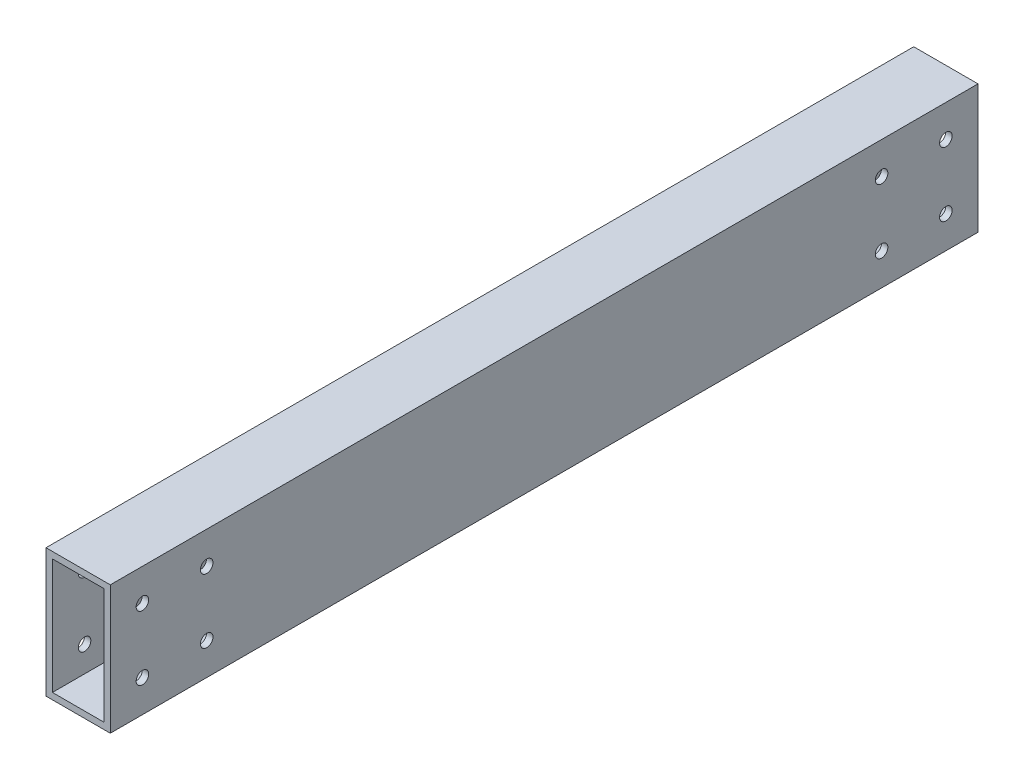
ISO-10303-21;
HEADER;
FILE_DESCRIPTION(('STEP AP214'),'2;1');
FILE_NAME('part.step','',(''),(''),'','','');
FILE_SCHEMA(('AUTOMOTIVE_DESIGN { 1 0 10303 214 1 1 1 1 }'));
ENDSEC;
DATA;
#1=APPLICATION_CONTEXT('core data for automotive mechanical design processes');
#2=APPLICATION_PROTOCOL_DEFINITION('international standard','automotive_design',2000,#1);
#3=PRODUCT_CONTEXT('',#1,'mechanical');
#4=PRODUCT('Part','Part','',(#3));
#5=PRODUCT_RELATED_PRODUCT_CATEGORY('part','',(#4));
#6=PRODUCT_DEFINITION_FORMATION('','',#4);
#7=PRODUCT_DEFINITION_CONTEXT('part definition',#1,'design');
#8=PRODUCT_DEFINITION('design','',#6,#7);
#9=PRODUCT_DEFINITION_SHAPE('','',#8);
#10=(LENGTH_UNIT() NAMED_UNIT(*) SI_UNIT(.MILLI.,.METRE.));
#11=(NAMED_UNIT(*) PLANE_ANGLE_UNIT() SI_UNIT($,.RADIAN.));
#12=(NAMED_UNIT(*) SI_UNIT($,.STERADIAN.) SOLID_ANGLE_UNIT());
#13=UNCERTAINTY_MEASURE_WITH_UNIT(LENGTH_MEASURE(1.E-05),#10,'distance_accuracy_value','');
#14=(GEOMETRIC_REPRESENTATION_CONTEXT(3) GLOBAL_UNCERTAINTY_ASSIGNED_CONTEXT((#13)) GLOBAL_UNIT_ASSIGNED_CONTEXT((#10,
#11,#12)) REPRESENTATION_CONTEXT('',''));
#15=CARTESIAN_POINT('',(0.,0.,0.));
#16=DIRECTION('',(0.,0.,1.));
#17=DIRECTION('',(1.,0.,0.));
#18=AXIS2_PLACEMENT_3D('',#15,#16,#17);
#19=CARTESIAN_POINT('',(12.7,-25.4,-171.45));
#20=DIRECTION('',(1.,0.,0.));
#21=DIRECTION('',(0.,0.,-1.));
#22=AXIS2_PLACEMENT_3D('',#19,#20,#21);
#23=PLANE('',#22);
#24=CARTESIAN_POINT('',(12.7,12.7,133.35));
#25=DIRECTION('',(1.,0.,0.));
#26=DIRECTION('',(0.,0.,-1.));
#27=AXIS2_PLACEMENT_3D('',#24,#25,#26);
#28=CIRCLE('',#27,2.4765);
#29=CARTESIAN_POINT('',(12.7,12.7,130.8735));
#30=VERTEX_POINT('',#29);
#31=EDGE_CURVE('E257',#30,#30,#28,.T.);
#32=ORIENTED_EDGE('',*,*,#31,.F.);
#33=EDGE_LOOP('',(#32));
#34=FACE_BOUND('',#33,.T.);
#35=CARTESIAN_POINT('',(12.7,12.7,-158.75));
#36=DIRECTION('',(1.,0.,0.));
#37=DIRECTION('',(0.,0.,-1.));
#38=AXIS2_PLACEMENT_3D('',#35,#36,#37);
#39=CIRCLE('',#38,2.4765);
#40=CARTESIAN_POINT('',(12.7,12.7,-161.2265));
#41=VERTEX_POINT('',#40);
#42=EDGE_CURVE('E256',#41,#41,#39,.T.);
#43=ORIENTED_EDGE('',*,*,#42,.F.);
#44=EDGE_LOOP('',(#43));
#45=FACE_BOUND('',#44,.T.);
#46=CARTESIAN_POINT('',(12.7,-12.7,-158.75));
#47=DIRECTION('',(1.,0.,0.));
#48=DIRECTION('',(0.,0.,-1.));
#49=AXIS2_PLACEMENT_3D('',#46,#47,#48);
#50=CIRCLE('',#49,2.4765);
#51=CARTESIAN_POINT('',(12.7,-12.7,-161.2265));
#52=VERTEX_POINT('',#51);
#53=EDGE_CURVE('E245',#52,#52,#50,.T.);
#54=ORIENTED_EDGE('',*,*,#53,.F.);
#55=EDGE_LOOP('',(#54));
#56=FACE_BOUND('',#55,.T.);
#57=CARTESIAN_POINT('',(12.7,12.7,-133.35));
#58=DIRECTION('',(1.,0.,0.));
#59=DIRECTION('',(0.,0.,-1.));
#60=AXIS2_PLACEMENT_3D('',#57,#58,#59);
#61=CIRCLE('',#60,2.4765);
#62=CARTESIAN_POINT('',(12.7,12.7,-135.8265));
#63=VERTEX_POINT('',#62);
#64=EDGE_CURVE('E244',#63,#63,#61,.T.);
#65=ORIENTED_EDGE('',*,*,#64,.F.);
#66=EDGE_LOOP('',(#65));
#67=FACE_BOUND('',#66,.T.);
#68=CARTESIAN_POINT('',(12.7,12.7,158.75));
#69=DIRECTION('',(1.,0.,0.));
#70=DIRECTION('',(0.,0.,-1.));
#71=AXIS2_PLACEMENT_3D('',#68,#69,#70);
#72=CIRCLE('',#71,2.4765);
#73=CARTESIAN_POINT('',(12.7,12.7,156.2735));
#74=VERTEX_POINT('',#73);
#75=EDGE_CURVE('E275',#74,#74,#72,.T.);
#76=ORIENTED_EDGE('',*,*,#75,.F.);
#77=EDGE_LOOP('',(#76));
#78=FACE_BOUND('',#77,.T.);
#79=CARTESIAN_POINT('',(12.7,-12.7,158.75));
#80=DIRECTION('',(1.,0.,0.));
#81=DIRECTION('',(0.,0.,-1.));
#82=AXIS2_PLACEMENT_3D('',#79,#80,#81);
#83=CIRCLE('',#82,2.4765);
#84=CARTESIAN_POINT('',(12.7,-12.7,156.2735));
#85=VERTEX_POINT('',#84);
#86=EDGE_CURVE('E268',#85,#85,#83,.T.);
#87=ORIENTED_EDGE('',*,*,#86,.F.);
#88=EDGE_LOOP('',(#87));
#89=FACE_BOUND('',#88,.T.);
#90=CARTESIAN_POINT('',(12.7,-12.7,133.35));
#91=DIRECTION('',(1.,0.,0.));
#92=DIRECTION('',(0.,0.,-1.));
#93=AXIS2_PLACEMENT_3D('',#90,#91,#92);
#94=CIRCLE('',#93,2.4765);
#95=CARTESIAN_POINT('',(12.7,-12.7,130.8735));
#96=VERTEX_POINT('',#95);
#97=EDGE_CURVE('E269',#96,#96,#94,.T.);
#98=ORIENTED_EDGE('',*,*,#97,.F.);
#99=EDGE_LOOP('',(#98));
#100=FACE_BOUND('',#99,.T.);
#101=CARTESIAN_POINT('',(12.7,-12.7,-133.35));
#102=DIRECTION('',(1.,0.,0.));
#103=DIRECTION('',(0.,0.,-1.));
#104=AXIS2_PLACEMENT_3D('',#101,#102,#103);
#105=CIRCLE('',#104,2.4765);
#106=CARTESIAN_POINT('',(12.7,-12.7,-135.8265));
#107=VERTEX_POINT('',#106);
#108=EDGE_CURVE('E237',#107,#107,#105,.T.);
#109=ORIENTED_EDGE('',*,*,#108,.F.);
#110=EDGE_LOOP('',(#109));
#111=FACE_BOUND('',#110,.T.);
#112=DIRECTION('',(0.,1.,0.));
#113=VECTOR('',#112,1.);
#114=CARTESIAN_POINT('',(12.7,-25.4,171.45));
#115=LINE('',#114,#113);
#116=CARTESIAN_POINT('',(12.7,-25.4,171.45));
#117=VERTEX_POINT('',#116);
#118=CARTESIAN_POINT('',(12.7,25.4,171.45));
#119=VERTEX_POINT('',#118);
#120=EDGE_CURVE('E158',#117,#119,#115,.T.);
#121=ORIENTED_EDGE('',*,*,#120,.F.);
#122=DIRECTION('',(0.,0.,1.));
#123=VECTOR('',#122,1.);
#124=CARTESIAN_POINT('',(12.7,-25.4,-171.45));
#125=LINE('',#124,#123);
#126=CARTESIAN_POINT('',(12.7,-25.4,-171.45));
#127=VERTEX_POINT('',#126);
#128=EDGE_CURVE('E12',#127,#117,#125,.T.);
#129=ORIENTED_EDGE('',*,*,#128,.F.);
#130=DIRECTION('',(0.,1.,0.));
#131=VECTOR('',#130,1.);
#132=CARTESIAN_POINT('',(12.7,-25.4,-171.45));
#133=LINE('',#132,#131);
#134=CARTESIAN_POINT('',(12.7,25.4,-171.45));
#135=VERTEX_POINT('',#134);
#136=EDGE_CURVE('E162',#127,#135,#133,.T.);
#137=ORIENTED_EDGE('',*,*,#136,.T.);
#138=DIRECTION('',(0.,0.,1.));
#139=VECTOR('',#138,1.);
#140=CARTESIAN_POINT('',(12.7,25.4,-171.45));
#141=LINE('',#140,#139);
#142=EDGE_CURVE('E175',#135,#119,#141,.T.);
#143=ORIENTED_EDGE('',*,*,#142,.T.);
#144=EDGE_LOOP('',(#121,#129,#137,#143));
#145=FACE_BOUND('',#144,.T.);
#146=ADVANCED_FACE('F57',(#34,#45,#56,#67,#78,#89,#100,#111,#145),#23,.T.);
#147=CARTESIAN_POINT('',(-12.7,-25.4,-171.45));
#148=DIRECTION('',(0.,-1.,0.));
#149=DIRECTION('',(0.,0.,-1.));
#150=AXIS2_PLACEMENT_3D('',#147,#148,#149);
#151=PLANE('',#150);
#152=DIRECTION('',(1.,0.,0.));
#153=VECTOR('',#152,1.);
#154=CARTESIAN_POINT('',(-12.7,-25.4,171.45));
#155=LINE('',#154,#153);
#156=CARTESIAN_POINT('',(-12.7,-25.4,171.45));
#157=VERTEX_POINT('',#156);
#158=EDGE_CURVE('E166',#157,#117,#155,.T.);
#159=ORIENTED_EDGE('',*,*,#158,.F.);
#160=DIRECTION('',(0.,0.,1.));
#161=VECTOR('',#160,1.);
#162=CARTESIAN_POINT('',(-12.7,-25.4,-171.45));
#163=LINE('',#162,#161);
#164=CARTESIAN_POINT('',(-12.7,-25.4,-171.45));
#165=VERTEX_POINT('',#164);
#166=EDGE_CURVE('E65',#165,#157,#163,.T.);
#167=ORIENTED_EDGE('',*,*,#166,.F.);
#168=DIRECTION('',(1.,0.,0.));
#169=VECTOR('',#168,1.);
#170=CARTESIAN_POINT('',(-12.7,-25.4,-171.45));
#171=LINE('',#170,#169);
#172=EDGE_CURVE('E172',#165,#127,#171,.T.);
#173=ORIENTED_EDGE('',*,*,#172,.T.);
#174=ORIENTED_EDGE('',*,*,#128,.T.);
#175=EDGE_LOOP('',(#159,#167,#173,#174));
#176=FACE_BOUND('',#175,.T.);
#177=ADVANCED_FACE('F288',(#176),#151,.T.);
#178=CARTESIAN_POINT('',(-12.7,-25.4,-171.45));
#179=DIRECTION('',(-1.,0.,0.));
#180=DIRECTION('',(0.,0.,1.));
#181=AXIS2_PLACEMENT_3D('',#178,#179,#180);
#182=PLANE('',#181);
#183=CARTESIAN_POINT('',(-12.7,12.7,133.35));
#184=DIRECTION('',(1.,0.,0.));
#185=DIRECTION('',(0.,0.,-1.));
#186=AXIS2_PLACEMENT_3D('',#183,#184,#185);
#187=CIRCLE('',#186,2.4765);
#188=CARTESIAN_POINT('',(-12.7,12.7,130.8735));
#189=VERTEX_POINT('',#188);
#190=EDGE_CURVE('E253',#189,#189,#187,.T.);
#191=ORIENTED_EDGE('',*,*,#190,.T.);
#192=EDGE_LOOP('',(#191));
#193=FACE_BOUND('',#192,.T.);
#194=CARTESIAN_POINT('',(-12.7,12.7,-158.75));
#195=DIRECTION('',(1.,0.,0.));
#196=DIRECTION('',(0.,0.,-1.));
#197=AXIS2_PLACEMENT_3D('',#194,#195,#196);
#198=CIRCLE('',#197,2.4765);
#199=CARTESIAN_POINT('',(-12.7,12.7,-161.2265));
#200=VERTEX_POINT('',#199);
#201=EDGE_CURVE('E248',#200,#200,#198,.T.);
#202=ORIENTED_EDGE('',*,*,#201,.T.);
#203=EDGE_LOOP('',(#202));
#204=FACE_BOUND('',#203,.T.);
#205=CARTESIAN_POINT('',(-12.7,-12.7,-158.75));
#206=DIRECTION('',(1.,0.,0.));
#207=DIRECTION('',(0.,0.,-1.));
#208=AXIS2_PLACEMENT_3D('',#205,#206,#207);
#209=CIRCLE('',#208,2.4765);
#210=CARTESIAN_POINT('',(-12.7,-12.7,-161.2265));
#211=VERTEX_POINT('',#210);
#212=EDGE_CURVE('E241',#211,#211,#209,.T.);
#213=ORIENTED_EDGE('',*,*,#212,.T.);
#214=EDGE_LOOP('',(#213));
#215=FACE_BOUND('',#214,.T.);
#216=CARTESIAN_POINT('',(-12.7,12.7,-133.35));
#217=DIRECTION('',(1.,0.,0.));
#218=DIRECTION('',(0.,0.,-1.));
#219=AXIS2_PLACEMENT_3D('',#216,#217,#218);
#220=CIRCLE('',#219,2.4765);
#221=CARTESIAN_POINT('',(-12.7,12.7,-135.8265));
#222=VERTEX_POINT('',#221);
#223=EDGE_CURVE('E240',#222,#222,#220,.T.);
#224=ORIENTED_EDGE('',*,*,#223,.T.);
#225=EDGE_LOOP('',(#224));
#226=FACE_BOUND('',#225,.T.);
#227=CARTESIAN_POINT('',(-12.7,12.7,158.75));
#228=DIRECTION('',(1.,0.,0.));
#229=DIRECTION('',(0.,0.,-1.));
#230=AXIS2_PLACEMENT_3D('',#227,#228,#229);
#231=CIRCLE('',#230,2.4765);
#232=CARTESIAN_POINT('',(-12.7,12.7,156.2735));
#233=VERTEX_POINT('',#232);
#234=EDGE_CURVE('E260',#233,#233,#231,.T.);
#235=ORIENTED_EDGE('',*,*,#234,.T.);
#236=EDGE_LOOP('',(#235));
#237=FACE_BOUND('',#236,.T.);
#238=CARTESIAN_POINT('',(-12.7,-12.7,158.75));
#239=DIRECTION('',(1.,0.,0.));
#240=DIRECTION('',(0.,0.,-1.));
#241=AXIS2_PLACEMENT_3D('',#238,#239,#240);
#242=CIRCLE('',#241,2.4765);
#243=CARTESIAN_POINT('',(-12.7,-12.7,156.2735));
#244=VERTEX_POINT('',#243);
#245=EDGE_CURVE('E272',#244,#244,#242,.T.);
#246=ORIENTED_EDGE('',*,*,#245,.T.);
#247=EDGE_LOOP('',(#246));
#248=FACE_BOUND('',#247,.T.);
#249=CARTESIAN_POINT('',(-12.7,-12.7,133.35));
#250=DIRECTION('',(1.,0.,0.));
#251=DIRECTION('',(0.,0.,-1.));
#252=AXIS2_PLACEMENT_3D('',#249,#250,#251);
#253=CIRCLE('',#252,2.4765);
#254=CARTESIAN_POINT('',(-12.7,-12.7,130.8735));
#255=VERTEX_POINT('',#254);
#256=EDGE_CURVE('E265',#255,#255,#253,.T.);
#257=ORIENTED_EDGE('',*,*,#256,.T.);
#258=EDGE_LOOP('',(#257));
#259=FACE_BOUND('',#258,.T.);
#260=CARTESIAN_POINT('',(-12.7,-12.7,-133.35));
#261=DIRECTION('',(1.,0.,0.));
#262=DIRECTION('',(0.,0.,-1.));
#263=AXIS2_PLACEMENT_3D('',#260,#261,#262);
#264=CIRCLE('',#263,2.4765);
#265=CARTESIAN_POINT('',(-12.7,-12.7,-135.8265));
#266=VERTEX_POINT('',#265);
#267=EDGE_CURVE('E194',#266,#266,#264,.T.);
#268=ORIENTED_EDGE('',*,*,#267,.T.);
#269=EDGE_LOOP('',(#268));
#270=FACE_BOUND('',#269,.T.);
#271=DIRECTION('',(0.,-1.,0.));
#272=VECTOR('',#271,1.);
#273=CARTESIAN_POINT('',(-12.7,-25.4,171.45));
#274=LINE('',#273,#272);
#275=CARTESIAN_POINT('',(-12.7,25.4,171.45));
#276=VERTEX_POINT('',#275);
#277=EDGE_CURVE('E181',#276,#157,#274,.T.);
#278=ORIENTED_EDGE('',*,*,#277,.F.);
#279=DIRECTION('',(0.,0.,1.));
#280=VECTOR('',#279,1.);
#281=CARTESIAN_POINT('',(-12.7,25.4,-171.45));
#282=LINE('',#281,#280);
#283=CARTESIAN_POINT('',(-12.7,25.4,-171.45));
#284=VERTEX_POINT('',#283);
#285=EDGE_CURVE('E187',#284,#276,#282,.T.);
#286=ORIENTED_EDGE('',*,*,#285,.F.);
#287=DIRECTION('',(0.,-1.,0.));
#288=VECTOR('',#287,1.);
#289=CARTESIAN_POINT('',(-12.7,-25.4,-171.45));
#290=LINE('',#289,#288);
#291=EDGE_CURVE('E169',#284,#165,#290,.T.);
#292=ORIENTED_EDGE('',*,*,#291,.T.);
#293=ORIENTED_EDGE('',*,*,#166,.T.);
#294=EDGE_LOOP('',(#278,#286,#292,#293));
#295=FACE_BOUND('',#294,.T.);
#296=ADVANCED_FACE('F310',(#193,#204,#215,#226,#237,#248,#259,#270,#295),#182,.T.);
#297=CARTESIAN_POINT('',(-12.7,25.4,-171.45));
#298=DIRECTION('',(0.,1.,0.));
#299=DIRECTION('',(0.,0.,1.));
#300=AXIS2_PLACEMENT_3D('',#297,#298,#299);
#301=PLANE('',#300);
#302=DIRECTION('',(-1.,0.,0.));
#303=VECTOR('',#302,1.);
#304=CARTESIAN_POINT('',(-12.7,25.4,171.45));
#305=LINE('',#304,#303);
#306=EDGE_CURVE('E178',#119,#276,#305,.T.);
#307=ORIENTED_EDGE('',*,*,#306,.F.);
#308=ORIENTED_EDGE('',*,*,#142,.F.);
#309=DIRECTION('',(-1.,0.,0.));
#310=VECTOR('',#309,1.);
#311=CARTESIAN_POINT('',(-12.7,25.4,-171.45));
#312=LINE('',#311,#310);
#313=EDGE_CURVE('E165',#135,#284,#312,.T.);
#314=ORIENTED_EDGE('',*,*,#313,.T.);
#315=ORIENTED_EDGE('',*,*,#285,.T.);
#316=EDGE_LOOP('',(#307,#308,#314,#315));
#317=FACE_BOUND('',#316,.T.);
#318=ADVANCED_FACE('F308',(#317),#301,.T.);
#319=CARTESIAN_POINT('',(0.,0.,-171.45));
#320=DIRECTION('',(0.,0.,1.));
#321=DIRECTION('',(1.,0.,0.));
#322=AXIS2_PLACEMENT_3D('',#319,#320,#321);
#323=PLANE('',#322);
#324=DIRECTION('',(1.,0.,0.));
#325=VECTOR('',#324,1.);
#326=CARTESIAN_POINT('',(0.,-22.86,-171.45));
#327=LINE('',#326,#325);
#328=CARTESIAN_POINT('',(-10.16,-22.86,-171.45));
#329=VERTEX_POINT('',#328);
#330=CARTESIAN_POINT('',(10.16,-22.86,-171.45));
#331=VERTEX_POINT('',#330);
#332=EDGE_CURVE('E130',#329,#331,#327,.T.);
#333=ORIENTED_EDGE('',*,*,#332,.T.);
#334=DIRECTION('',(0.,1.,0.));
#335=VECTOR('',#334,1.);
#336=CARTESIAN_POINT('',(10.16,0.,-171.45));
#337=LINE('',#336,#335);
#338=CARTESIAN_POINT('',(10.16,22.86,-171.45));
#339=VERTEX_POINT('',#338);
#340=EDGE_CURVE('E124',#331,#339,#337,.T.);
#341=ORIENTED_EDGE('',*,*,#340,.T.);
#342=DIRECTION('',(-1.,0.,0.));
#343=VECTOR('',#342,1.);
#344=CARTESIAN_POINT('',(0.,22.86,-171.45));
#345=LINE('',#344,#343);
#346=CARTESIAN_POINT('',(-10.16,22.86,-171.45));
#347=VERTEX_POINT('',#346);
#348=EDGE_CURVE('E133',#339,#347,#345,.T.);
#349=ORIENTED_EDGE('',*,*,#348,.T.);
#350=DIRECTION('',(0.,-1.,0.));
#351=VECTOR('',#350,1.);
#352=CARTESIAN_POINT('',(-10.16,0.,-171.45));
#353=LINE('',#352,#351);
#354=EDGE_CURVE('E73',#347,#329,#353,.T.);
#355=ORIENTED_EDGE('',*,*,#354,.T.);
#356=EDGE_LOOP('',(#333,#341,#349,#355));
#357=FACE_BOUND('',#356,.T.);
#358=ORIENTED_EDGE('',*,*,#136,.F.);
#359=ORIENTED_EDGE('',*,*,#172,.F.);
#360=ORIENTED_EDGE('',*,*,#291,.F.);
#361=ORIENTED_EDGE('',*,*,#313,.F.);
#362=EDGE_LOOP('',(#358,#359,#360,#361));
#363=FACE_BOUND('',#362,.T.);
#364=ADVANCED_FACE('F137',(#357,#363),#323,.F.);
#365=CARTESIAN_POINT('',(0.,0.,171.45));
#366=DIRECTION('',(0.,0.,1.));
#367=DIRECTION('',(1.,0.,0.));
#368=AXIS2_PLACEMENT_3D('',#365,#366,#367);
#369=PLANE('',#368);
#370=DIRECTION('',(0.,1.,0.));
#371=VECTOR('',#370,1.);
#372=CARTESIAN_POINT('',(10.16,0.,171.45));
#373=LINE('',#372,#371);
#374=CARTESIAN_POINT('',(10.16,-22.86,171.45));
#375=VERTEX_POINT('',#374);
#376=CARTESIAN_POINT('',(10.16,22.86,171.45));
#377=VERTEX_POINT('',#376);
#378=EDGE_CURVE('E81',#375,#377,#373,.T.);
#379=ORIENTED_EDGE('',*,*,#378,.F.);
#380=DIRECTION('',(1.,0.,0.));
#381=VECTOR('',#380,1.);
#382=CARTESIAN_POINT('',(0.,-22.86,171.45));
#383=LINE('',#382,#381);
#384=CARTESIAN_POINT('',(-10.16,-22.86,171.45));
#385=VERTEX_POINT('',#384);
#386=EDGE_CURVE('E140',#385,#375,#383,.T.);
#387=ORIENTED_EDGE('',*,*,#386,.F.);
#388=DIRECTION('',(0.,-1.,0.));
#389=VECTOR('',#388,1.);
#390=CARTESIAN_POINT('',(-10.16,0.,171.45));
#391=LINE('',#390,#389);
#392=CARTESIAN_POINT('',(-10.16,22.86,171.45));
#393=VERTEX_POINT('',#392);
#394=EDGE_CURVE('E143',#393,#385,#391,.T.);
#395=ORIENTED_EDGE('',*,*,#394,.F.);
#396=DIRECTION('',(-1.,0.,0.));
#397=VECTOR('',#396,1.);
#398=CARTESIAN_POINT('',(0.,22.86,171.45));
#399=LINE('',#398,#397);
#400=EDGE_CURVE('E152',#377,#393,#399,.T.);
#401=ORIENTED_EDGE('',*,*,#400,.F.);
#402=EDGE_LOOP('',(#379,#387,#395,#401));
#403=FACE_BOUND('',#402,.T.);
#404=ORIENTED_EDGE('',*,*,#120,.T.);
#405=ORIENTED_EDGE('',*,*,#306,.T.);
#406=ORIENTED_EDGE('',*,*,#277,.T.);
#407=ORIENTED_EDGE('',*,*,#158,.T.);
#408=EDGE_LOOP('',(#404,#405,#406,#407));
#409=FACE_BOUND('',#408,.T.);
#410=ADVANCED_FACE('F301',(#403,#409),#369,.T.);
#411=CARTESIAN_POINT('',(10.16,0.,-171.45));
#412=DIRECTION('',(1.,0.,0.));
#413=DIRECTION('',(0.,0.,-1.));
#414=AXIS2_PLACEMENT_3D('',#411,#412,#413);
#415=PLANE('',#414);
#416=CARTESIAN_POINT('',(10.16,12.7,133.35));
#417=DIRECTION('',(1.,0.,0.));
#418=DIRECTION('',(0.,0.,-1.));
#419=AXIS2_PLACEMENT_3D('',#416,#417,#418);
#420=CIRCLE('',#419,2.4765);
#421=CARTESIAN_POINT('',(10.16,12.7,130.8735));
#422=VERTEX_POINT('',#421);
#423=EDGE_CURVE('E146',#422,#422,#420,.T.);
#424=ORIENTED_EDGE('',*,*,#423,.T.);
#425=EDGE_LOOP('',(#424));
#426=FACE_BOUND('',#425,.T.);
#427=CARTESIAN_POINT('',(10.16,12.7,-158.75));
#428=DIRECTION('',(1.,0.,0.));
#429=DIRECTION('',(0.,0.,-1.));
#430=AXIS2_PLACEMENT_3D('',#427,#428,#429);
#431=CIRCLE('',#430,2.4765);
#432=CARTESIAN_POINT('',(10.16,12.7,-161.2265));
#433=VERTEX_POINT('',#432);
#434=EDGE_CURVE('E216',#433,#433,#431,.T.);
#435=ORIENTED_EDGE('',*,*,#434,.T.);
#436=EDGE_LOOP('',(#435));
#437=FACE_BOUND('',#436,.T.);
#438=CARTESIAN_POINT('',(10.16,-12.7,-158.75));
#439=DIRECTION('',(1.,0.,0.));
#440=DIRECTION('',(0.,0.,-1.));
#441=AXIS2_PLACEMENT_3D('',#438,#439,#440);
#442=CIRCLE('',#441,2.4765);
#443=CARTESIAN_POINT('',(10.16,-12.7,-161.2265));
#444=VERTEX_POINT('',#443);
#445=EDGE_CURVE('E213',#444,#444,#442,.T.);
#446=ORIENTED_EDGE('',*,*,#445,.T.);
#447=EDGE_LOOP('',(#446));
#448=FACE_BOUND('',#447,.T.);
#449=CARTESIAN_POINT('',(10.16,12.7,-133.35));
#450=DIRECTION('',(1.,0.,0.));
#451=DIRECTION('',(0.,0.,-1.));
#452=AXIS2_PLACEMENT_3D('',#449,#450,#451);
#453=CIRCLE('',#452,2.4765);
#454=CARTESIAN_POINT('',(10.16,12.7,-135.8265));
#455=VERTEX_POINT('',#454);
#456=EDGE_CURVE('E210',#455,#455,#453,.T.);
#457=ORIENTED_EDGE('',*,*,#456,.T.);
#458=EDGE_LOOP('',(#457));
#459=FACE_BOUND('',#458,.T.);
#460=CARTESIAN_POINT('',(10.16,12.7,158.75));
#461=DIRECTION('',(1.,0.,0.));
#462=DIRECTION('',(0.,0.,-1.));
#463=AXIS2_PLACEMENT_3D('',#460,#461,#462);
#464=CIRCLE('',#463,2.4765);
#465=CARTESIAN_POINT('',(10.16,12.7,156.2735));
#466=VERTEX_POINT('',#465);
#467=EDGE_CURVE('E206',#466,#466,#464,.T.);
#468=ORIENTED_EDGE('',*,*,#467,.T.);
#469=EDGE_LOOP('',(#468));
#470=FACE_BOUND('',#469,.T.);
#471=CARTESIAN_POINT('',(10.16,-12.7,158.75));
#472=DIRECTION('',(1.,0.,0.));
#473=DIRECTION('',(0.,0.,-1.));
#474=AXIS2_PLACEMENT_3D('',#471,#472,#473);
#475=CIRCLE('',#474,2.4765);
#476=CARTESIAN_POINT('',(10.16,-12.7,156.2735));
#477=VERTEX_POINT('',#476);
#478=EDGE_CURVE('E202',#477,#477,#475,.T.);
#479=ORIENTED_EDGE('',*,*,#478,.T.);
#480=EDGE_LOOP('',(#479));
#481=FACE_BOUND('',#480,.T.);
#482=CARTESIAN_POINT('',(10.16,-12.7,133.35));
#483=DIRECTION('',(1.,0.,0.));
#484=DIRECTION('',(0.,0.,-1.));
#485=AXIS2_PLACEMENT_3D('',#482,#483,#484);
#486=CIRCLE('',#485,2.4765);
#487=CARTESIAN_POINT('',(10.16,-12.7,130.8735));
#488=VERTEX_POINT('',#487);
#489=EDGE_CURVE('E198',#488,#488,#486,.T.);
#490=ORIENTED_EDGE('',*,*,#489,.T.);
#491=EDGE_LOOP('',(#490));
#492=FACE_BOUND('',#491,.T.);
#493=CARTESIAN_POINT('',(10.16,-12.7,-133.35));
#494=DIRECTION('',(1.,0.,0.));
#495=DIRECTION('',(0.,0.,-1.));
#496=AXIS2_PLACEMENT_3D('',#493,#494,#495);
#497=CIRCLE('',#496,2.4765);
#498=CARTESIAN_POINT('',(10.16,-12.7,-135.8265));
#499=VERTEX_POINT('',#498);
#500=EDGE_CURVE('E193',#499,#499,#497,.T.);
#501=ORIENTED_EDGE('',*,*,#500,.T.);
#502=EDGE_LOOP('',(#501));
#503=FACE_BOUND('',#502,.T.);
#504=ORIENTED_EDGE('',*,*,#378,.T.);
#505=DIRECTION('',(0.,0.,1.));
#506=VECTOR('',#505,1.);
#507=CARTESIAN_POINT('',(10.16,22.86,-171.45));
#508=LINE('',#507,#506);
#509=EDGE_CURVE('E120',#339,#377,#508,.T.);
#510=ORIENTED_EDGE('',*,*,#509,.F.);
#511=ORIENTED_EDGE('',*,*,#340,.F.);
#512=DIRECTION('',(0.,0.,1.));
#513=VECTOR('',#512,1.);
#514=CARTESIAN_POINT('',(10.16,-22.86,-171.45));
#515=LINE('',#514,#513);
#516=EDGE_CURVE('E156',#331,#375,#515,.T.);
#517=ORIENTED_EDGE('',*,*,#516,.T.);
#518=EDGE_LOOP('',(#504,#510,#511,#517));
#519=FACE_BOUND('',#518,.T.);
#520=ADVANCED_FACE('F122',(#426,#437,#448,#459,#470,#481,#492,#503,#519),#415,.F.);
#521=CARTESIAN_POINT('',(0.,-22.86,-171.45));
#522=DIRECTION('',(0.,-1.,0.));
#523=DIRECTION('',(0.,0.,-1.));
#524=AXIS2_PLACEMENT_3D('',#521,#522,#523);
#525=PLANE('',#524);
#526=ORIENTED_EDGE('',*,*,#386,.T.);
#527=ORIENTED_EDGE('',*,*,#516,.F.);
#528=ORIENTED_EDGE('',*,*,#332,.F.);
#529=DIRECTION('',(0.,0.,1.));
#530=VECTOR('',#529,1.);
#531=CARTESIAN_POINT('',(-10.16,-22.86,-171.45));
#532=LINE('',#531,#530);
#533=EDGE_CURVE('E159',#329,#385,#532,.T.);
#534=ORIENTED_EDGE('',*,*,#533,.T.);
#535=EDGE_LOOP('',(#526,#527,#528,#534));
#536=FACE_BOUND('',#535,.T.);
#537=ADVANCED_FACE('F328',(#536),#525,.F.);
#538=CARTESIAN_POINT('',(-10.16,0.,-171.45));
#539=DIRECTION('',(-1.,0.,0.));
#540=DIRECTION('',(0.,0.,1.));
#541=AXIS2_PLACEMENT_3D('',#538,#539,#540);
#542=PLANE('',#541);
#543=CARTESIAN_POINT('',(-10.16,12.7,133.35));
#544=DIRECTION('',(-1.,0.,0.));
#545=DIRECTION('',(0.,0.,1.));
#546=AXIS2_PLACEMENT_3D('',#543,#544,#545);
#547=CIRCLE('',#546,2.4765);
#548=CARTESIAN_POINT('',(-10.16,12.7,135.8265));
#549=VERTEX_POINT('',#548);
#550=EDGE_CURVE('E60',#549,#549,#547,.T.);
#551=ORIENTED_EDGE('',*,*,#550,.T.);
#552=EDGE_LOOP('',(#551));
#553=FACE_BOUND('',#552,.T.);
#554=CARTESIAN_POINT('',(-10.16,12.7,-158.75));
#555=DIRECTION('',(-1.,0.,0.));
#556=DIRECTION('',(0.,0.,1.));
#557=AXIS2_PLACEMENT_3D('',#554,#555,#556);
#558=CIRCLE('',#557,2.4765);
#559=CARTESIAN_POINT('',(-10.16,12.7,-156.2735));
#560=VERTEX_POINT('',#559);
#561=EDGE_CURVE('E214',#560,#560,#558,.T.);
#562=ORIENTED_EDGE('',*,*,#561,.T.);
#563=EDGE_LOOP('',(#562));
#564=FACE_BOUND('',#563,.T.);
#565=CARTESIAN_POINT('',(-10.16,-12.7,-158.75));
#566=DIRECTION('',(-1.,0.,0.));
#567=DIRECTION('',(0.,0.,1.));
#568=AXIS2_PLACEMENT_3D('',#565,#566,#567);
#569=CIRCLE('',#568,2.4765);
#570=CARTESIAN_POINT('',(-10.16,-12.7,-156.2735));
#571=VERTEX_POINT('',#570);
#572=EDGE_CURVE('E211',#571,#571,#569,.T.);
#573=ORIENTED_EDGE('',*,*,#572,.T.);
#574=EDGE_LOOP('',(#573));
#575=FACE_BOUND('',#574,.T.);
#576=CARTESIAN_POINT('',(-10.16,12.7,-133.35));
#577=DIRECTION('',(-1.,0.,0.));
#578=DIRECTION('',(0.,0.,1.));
#579=AXIS2_PLACEMENT_3D('',#576,#577,#578);
#580=CIRCLE('',#579,2.4765);
#581=CARTESIAN_POINT('',(-10.16,12.7,-130.8735));
#582=VERTEX_POINT('',#581);
#583=EDGE_CURVE('E207',#582,#582,#580,.T.);
#584=ORIENTED_EDGE('',*,*,#583,.T.);
#585=EDGE_LOOP('',(#584));
#586=FACE_BOUND('',#585,.T.);
#587=CARTESIAN_POINT('',(-10.16,12.7,158.75));
#588=DIRECTION('',(-1.,0.,0.));
#589=DIRECTION('',(0.,0.,1.));
#590=AXIS2_PLACEMENT_3D('',#587,#588,#589);
#591=CIRCLE('',#590,2.4765);
#592=CARTESIAN_POINT('',(-10.16,12.7,161.2265));
#593=VERTEX_POINT('',#592);
#594=EDGE_CURVE('E203',#593,#593,#591,.T.);
#595=ORIENTED_EDGE('',*,*,#594,.T.);
#596=EDGE_LOOP('',(#595));
#597=FACE_BOUND('',#596,.T.);
#598=CARTESIAN_POINT('',(-10.16,-12.7,158.75));
#599=DIRECTION('',(-1.,0.,0.));
#600=DIRECTION('',(0.,0.,1.));
#601=AXIS2_PLACEMENT_3D('',#598,#599,#600);
#602=CIRCLE('',#601,2.4765);
#603=CARTESIAN_POINT('',(-10.16,-12.7,161.2265));
#604=VERTEX_POINT('',#603);
#605=EDGE_CURVE('E199',#604,#604,#602,.T.);
#606=ORIENTED_EDGE('',*,*,#605,.T.);
#607=EDGE_LOOP('',(#606));
#608=FACE_BOUND('',#607,.T.);
#609=CARTESIAN_POINT('',(-10.16,-12.7,133.35));
#610=DIRECTION('',(-1.,0.,0.));
#611=DIRECTION('',(0.,0.,1.));
#612=AXIS2_PLACEMENT_3D('',#609,#610,#611);
#613=CIRCLE('',#612,2.4765);
#614=CARTESIAN_POINT('',(-10.16,-12.7,135.8265));
#615=VERTEX_POINT('',#614);
#616=EDGE_CURVE('E195',#615,#615,#613,.T.);
#617=ORIENTED_EDGE('',*,*,#616,.T.);
#618=EDGE_LOOP('',(#617));
#619=FACE_BOUND('',#618,.T.);
#620=CARTESIAN_POINT('',(-10.16,-12.7,-133.35));
#621=DIRECTION('',(-1.,0.,0.));
#622=DIRECTION('',(0.,0.,1.));
#623=AXIS2_PLACEMENT_3D('',#620,#621,#622);
#624=CIRCLE('',#623,2.4765);
#625=CARTESIAN_POINT('',(-10.16,-12.7,-130.8735));
#626=VERTEX_POINT('',#625);
#627=EDGE_CURVE('E190',#626,#626,#624,.T.);
#628=ORIENTED_EDGE('',*,*,#627,.T.);
#629=EDGE_LOOP('',(#628));
#630=FACE_BOUND('',#629,.T.);
#631=ORIENTED_EDGE('',*,*,#394,.T.);
#632=ORIENTED_EDGE('',*,*,#533,.F.);
#633=ORIENTED_EDGE('',*,*,#354,.F.);
#634=DIRECTION('',(0.,0.,1.));
#635=VECTOR('',#634,1.);
#636=CARTESIAN_POINT('',(-10.16,22.86,-171.45));
#637=LINE('',#636,#635);
#638=EDGE_CURVE('E129',#347,#393,#637,.T.);
#639=ORIENTED_EDGE('',*,*,#638,.T.);
#640=EDGE_LOOP('',(#631,#632,#633,#639));
#641=FACE_BOUND('',#640,.T.);
#642=ADVANCED_FACE('F333',(#553,#564,#575,#586,#597,#608,#619,#630,#641),#542,.F.);
#643=CARTESIAN_POINT('',(0.,22.86,-171.45));
#644=DIRECTION('',(0.,1.,0.));
#645=DIRECTION('',(0.,0.,1.));
#646=AXIS2_PLACEMENT_3D('',#643,#644,#645);
#647=PLANE('',#646);
#648=ORIENTED_EDGE('',*,*,#400,.T.);
#649=ORIENTED_EDGE('',*,*,#638,.F.);
#650=ORIENTED_EDGE('',*,*,#348,.F.);
#651=ORIENTED_EDGE('',*,*,#509,.T.);
#652=EDGE_LOOP('',(#648,#649,#650,#651));
#653=FACE_BOUND('',#652,.T.);
#654=ADVANCED_FACE('F134',(#653),#647,.F.);
#655=CARTESIAN_POINT('',(-12.7,-12.7,-133.35));
#656=DIRECTION('',(1.,0.,0.));
#657=DIRECTION('',(0.,0.,-1.));
#658=AXIS2_PLACEMENT_3D('',#655,#656,#657);
#659=CYLINDRICAL_SURFACE('',#658,2.4765);
#660=ORIENTED_EDGE('',*,*,#267,.F.);
#661=EDGE_LOOP('',(#660));
#662=FACE_BOUND('',#661,.T.);
#663=ORIENTED_EDGE('',*,*,#627,.F.);
#664=EDGE_LOOP('',(#663));
#665=FACE_BOUND('',#664,.T.);
#666=ADVANCED_FACE('F332',(#662,#665),#659,.F.);
#667=CARTESIAN_POINT('',(-12.7,-12.7,133.35));
#668=DIRECTION('',(1.,0.,0.));
#669=DIRECTION('',(0.,0.,-1.));
#670=AXIS2_PLACEMENT_3D('',#667,#668,#669);
#671=CYLINDRICAL_SURFACE('',#670,2.4765);
#672=ORIENTED_EDGE('',*,*,#256,.F.);
#673=EDGE_LOOP('',(#672));
#674=FACE_BOUND('',#673,.T.);
#675=ORIENTED_EDGE('',*,*,#616,.F.);
#676=EDGE_LOOP('',(#675));
#677=FACE_BOUND('',#676,.T.);
#678=ADVANCED_FACE('F369',(#674,#677),#671,.F.);
#679=CARTESIAN_POINT('',(-12.7,-12.7,158.75));
#680=DIRECTION('',(1.,0.,0.));
#681=DIRECTION('',(0.,0.,-1.));
#682=AXIS2_PLACEMENT_3D('',#679,#680,#681);
#683=CYLINDRICAL_SURFACE('',#682,2.4765);
#684=ORIENTED_EDGE('',*,*,#245,.F.);
#685=EDGE_LOOP('',(#684));
#686=FACE_BOUND('',#685,.T.);
#687=ORIENTED_EDGE('',*,*,#605,.F.);
#688=EDGE_LOOP('',(#687));
#689=FACE_BOUND('',#688,.T.);
#690=ADVANCED_FACE('F373',(#686,#689),#683,.F.);
#691=CARTESIAN_POINT('',(-12.7,12.7,158.75));
#692=DIRECTION('',(1.,0.,0.));
#693=DIRECTION('',(0.,0.,-1.));
#694=AXIS2_PLACEMENT_3D('',#691,#692,#693);
#695=CYLINDRICAL_SURFACE('',#694,2.4765);
#696=ORIENTED_EDGE('',*,*,#234,.F.);
#697=EDGE_LOOP('',(#696));
#698=FACE_BOUND('',#697,.T.);
#699=ORIENTED_EDGE('',*,*,#594,.F.);
#700=EDGE_LOOP('',(#699));
#701=FACE_BOUND('',#700,.T.);
#702=ADVANCED_FACE('F375',(#698,#701),#695,.F.);
#703=CARTESIAN_POINT('',(-12.7,12.7,-133.35));
#704=DIRECTION('',(1.,0.,0.));
#705=DIRECTION('',(0.,0.,-1.));
#706=AXIS2_PLACEMENT_3D('',#703,#704,#705);
#707=CYLINDRICAL_SURFACE('',#706,2.4765);
#708=ORIENTED_EDGE('',*,*,#223,.F.);
#709=EDGE_LOOP('',(#708));
#710=FACE_BOUND('',#709,.T.);
#711=ORIENTED_EDGE('',*,*,#583,.F.);
#712=EDGE_LOOP('',(#711));
#713=FACE_BOUND('',#712,.T.);
#714=ADVANCED_FACE('F356',(#710,#713),#707,.F.);
#715=CARTESIAN_POINT('',(-12.7,-12.7,-158.75));
#716=DIRECTION('',(1.,0.,0.));
#717=DIRECTION('',(0.,0.,-1.));
#718=AXIS2_PLACEMENT_3D('',#715,#716,#717);
#719=CYLINDRICAL_SURFACE('',#718,2.4765);
#720=ORIENTED_EDGE('',*,*,#212,.F.);
#721=EDGE_LOOP('',(#720));
#722=FACE_BOUND('',#721,.T.);
#723=ORIENTED_EDGE('',*,*,#572,.F.);
#724=EDGE_LOOP('',(#723));
#725=FACE_BOUND('',#724,.T.);
#726=ADVANCED_FACE('F352',(#722,#725),#719,.F.);
#727=CARTESIAN_POINT('',(-12.7,12.7,-158.75));
#728=DIRECTION('',(1.,0.,0.));
#729=DIRECTION('',(0.,0.,-1.));
#730=AXIS2_PLACEMENT_3D('',#727,#728,#729);
#731=CYLINDRICAL_SURFACE('',#730,2.4765);
#732=ORIENTED_EDGE('',*,*,#201,.F.);
#733=EDGE_LOOP('',(#732));
#734=FACE_BOUND('',#733,.T.);
#735=ORIENTED_EDGE('',*,*,#561,.F.);
#736=EDGE_LOOP('',(#735));
#737=FACE_BOUND('',#736,.T.);
#738=ADVANCED_FACE('F364',(#734,#737),#731,.F.);
#739=CARTESIAN_POINT('',(-12.7,12.7,133.35));
#740=DIRECTION('',(1.,0.,0.));
#741=DIRECTION('',(0.,0.,-1.));
#742=AXIS2_PLACEMENT_3D('',#739,#740,#741);
#743=CYLINDRICAL_SURFACE('',#742,2.4765);
#744=ORIENTED_EDGE('',*,*,#190,.F.);
#745=EDGE_LOOP('',(#744));
#746=FACE_BOUND('',#745,.T.);
#747=ORIENTED_EDGE('',*,*,#550,.F.);
#748=EDGE_LOOP('',(#747));
#749=FACE_BOUND('',#748,.T.);
#750=ADVANCED_FACE('F344',(#746,#749),#743,.F.);
#751=ORIENTED_EDGE('',*,*,#108,.T.);
#752=EDGE_LOOP('',(#751));
#753=FACE_BOUND('',#752,.T.);
#754=ORIENTED_EDGE('',*,*,#500,.F.);
#755=EDGE_LOOP('',(#754));
#756=FACE_BOUND('',#755,.T.);
#757=ADVANCED_FACE('F340',(#753,#756),#659,.F.);
#758=ORIENTED_EDGE('',*,*,#97,.T.);
#759=EDGE_LOOP('',(#758));
#760=FACE_BOUND('',#759,.T.);
#761=ORIENTED_EDGE('',*,*,#489,.F.);
#762=EDGE_LOOP('',(#761));
#763=FACE_BOUND('',#762,.T.);
#764=ADVANCED_FACE('F343',(#760,#763),#671,.F.);
#765=ORIENTED_EDGE('',*,*,#86,.T.);
#766=EDGE_LOOP('',(#765));
#767=FACE_BOUND('',#766,.T.);
#768=ORIENTED_EDGE('',*,*,#478,.F.);
#769=EDGE_LOOP('',(#768));
#770=FACE_BOUND('',#769,.T.);
#771=ADVANCED_FACE('F367',(#767,#770),#683,.F.);
#772=ORIENTED_EDGE('',*,*,#75,.T.);
#773=EDGE_LOOP('',(#772));
#774=FACE_BOUND('',#773,.T.);
#775=ORIENTED_EDGE('',*,*,#467,.F.);
#776=EDGE_LOOP('',(#775));
#777=FACE_BOUND('',#776,.T.);
#778=ADVANCED_FACE('F283',(#774,#777),#695,.F.);
#779=ORIENTED_EDGE('',*,*,#64,.T.);
#780=EDGE_LOOP('',(#779));
#781=FACE_BOUND('',#780,.T.);
#782=ORIENTED_EDGE('',*,*,#456,.F.);
#783=EDGE_LOOP('',(#782));
#784=FACE_BOUND('',#783,.T.);
#785=ADVANCED_FACE('F350',(#781,#784),#707,.F.);
#786=ORIENTED_EDGE('',*,*,#53,.T.);
#787=EDGE_LOOP('',(#786));
#788=FACE_BOUND('',#787,.T.);
#789=ORIENTED_EDGE('',*,*,#445,.F.);
#790=EDGE_LOOP('',(#789));
#791=FACE_BOUND('',#790,.T.);
#792=ADVANCED_FACE('F346',(#788,#791),#719,.F.);
#793=ORIENTED_EDGE('',*,*,#42,.T.);
#794=EDGE_LOOP('',(#793));
#795=FACE_BOUND('',#794,.T.);
#796=ORIENTED_EDGE('',*,*,#434,.F.);
#797=EDGE_LOOP('',(#796));
#798=FACE_BOUND('',#797,.T.);
#799=ADVANCED_FACE('F349',(#795,#798),#731,.F.);
#800=ORIENTED_EDGE('',*,*,#31,.T.);
#801=EDGE_LOOP('',(#800));
#802=FACE_BOUND('',#801,.T.);
#803=ORIENTED_EDGE('',*,*,#423,.F.);
#804=EDGE_LOOP('',(#803));
#805=FACE_BOUND('',#804,.T.);
#806=ADVANCED_FACE('F357',(#802,#805),#743,.F.);
#807=CLOSED_SHELL('',(#146,#177,#296,#318,#364,#410,#520,#537,#642,#654,#666,#678,#690,#702,
#714,#726,#738,#750,#757,#764,#771,#778,#785,#792,#799,#806));
#808=MANIFOLD_SOLID_BREP('B2',#807);
#809=ADVANCED_BREP_SHAPE_REPRESENTATION('',(#18,#808),#14);
#810=SHAPE_DEFINITION_REPRESENTATION(#9,#809);
ENDSEC;
END-ISO-10303-21;
